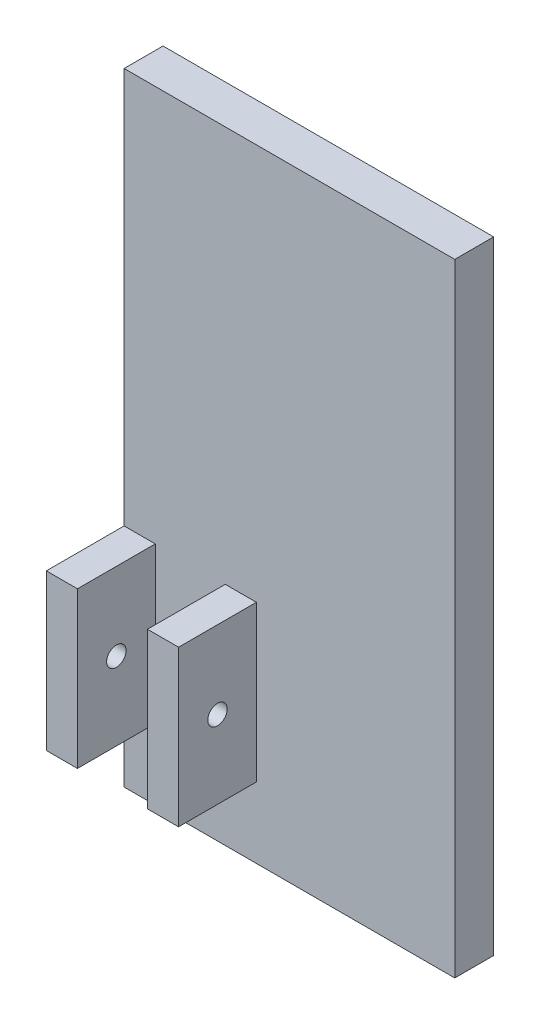
ISO-10303-21;
HEADER;
FILE_DESCRIPTION(('STEP AP214'),'2;1');
FILE_NAME('part.step','',(''),(''),'','','');
FILE_SCHEMA(('AUTOMOTIVE_DESIGN { 1 0 10303 214 1 1 1 1 }'));
ENDSEC;
DATA;
#1=APPLICATION_CONTEXT('core data for automotive mechanical design processes');
#2=APPLICATION_PROTOCOL_DEFINITION('international standard','automotive_design',2000,#1);
#3=PRODUCT_CONTEXT('',#1,'mechanical');
#4=PRODUCT('Part','Part','',(#3));
#5=PRODUCT_RELATED_PRODUCT_CATEGORY('part','',(#4));
#6=PRODUCT_DEFINITION_FORMATION('','',#4);
#7=PRODUCT_DEFINITION_CONTEXT('part definition',#1,'design');
#8=PRODUCT_DEFINITION('design','',#6,#7);
#9=PRODUCT_DEFINITION_SHAPE('','',#8);
#10=(LENGTH_UNIT() NAMED_UNIT(*) SI_UNIT(.MILLI.,.METRE.));
#11=(NAMED_UNIT(*) PLANE_ANGLE_UNIT() SI_UNIT($,.RADIAN.));
#12=(NAMED_UNIT(*) SI_UNIT($,.STERADIAN.) SOLID_ANGLE_UNIT());
#13=UNCERTAINTY_MEASURE_WITH_UNIT(LENGTH_MEASURE(1.E-05),#10,'distance_accuracy_value','');
#14=(GEOMETRIC_REPRESENTATION_CONTEXT(3) GLOBAL_UNCERTAINTY_ASSIGNED_CONTEXT((#13)) GLOBAL_UNIT_ASSIGNED_CONTEXT((#10,
#11,#12)) REPRESENTATION_CONTEXT('',''));
#15=CARTESIAN_POINT('',(0.,0.,0.));
#16=DIRECTION('',(0.,0.,1.));
#17=DIRECTION('',(1.,0.,0.));
#18=AXIS2_PLACEMENT_3D('',#15,#16,#17);
#19=CARTESIAN_POINT('',(0.,0.,10.));
#20=DIRECTION('',(0.,0.,-1.));
#21=DIRECTION('',(-1.,0.,0.));
#22=AXIS2_PLACEMENT_3D('',#19,#20,#21);
#23=PLANE('',#22);
#24=DIRECTION('',(-1.,0.,0.));
#25=VECTOR('',#24,1.);
#26=CARTESIAN_POINT('',(-15.,54.15,10.));
#27=LINE('',#26,#25);
#28=CARTESIAN_POINT('',(-7.,54.15,10.));
#29=VERTEX_POINT('',#28);
#30=CARTESIAN_POINT('',(-15.,54.15,10.));
#31=VERTEX_POINT('',#30);
#32=EDGE_CURVE('E163',#29,#31,#27,.T.);
#33=ORIENTED_EDGE('',*,*,#32,.F.);
#34=DIRECTION('',(0.,1.,0.));
#35=VECTOR('',#34,1.);
#36=CARTESIAN_POINT('',(-7.,14.15,10.));
#37=LINE('',#36,#35);
#38=CARTESIAN_POINT('',(-7.,14.15,10.));
#39=VERTEX_POINT('',#38);
#40=EDGE_CURVE('E170',#39,#29,#37,.T.);
#41=ORIENTED_EDGE('',*,*,#40,.F.);
#42=DIRECTION('',(1.,0.,0.));
#43=VECTOR('',#42,1.);
#44=CARTESIAN_POINT('',(-15.,14.15,10.));
#45=LINE('',#44,#43);
#46=CARTESIAN_POINT('',(-15.,14.15,10.));
#47=VERTEX_POINT('',#46);
#48=EDGE_CURVE('E173',#47,#39,#45,.T.);
#49=ORIENTED_EDGE('',*,*,#48,.F.);
#50=DIRECTION('',(0.,-1.,0.));
#51=VECTOR('',#50,1.);
#52=CARTESIAN_POINT('',(-15.,-4.,10.));
#53=LINE('',#52,#51);
#54=CARTESIAN_POINT('',(-15.,-4.,10.));
#55=VERTEX_POINT('',#54);
#56=EDGE_CURVE('E211',#47,#55,#53,.T.);
#57=ORIENTED_EDGE('',*,*,#56,.T.);
#58=DIRECTION('',(1.,0.,0.));
#59=VECTOR('',#58,1.);
#60=CARTESIAN_POINT('',(69.9999999999995,-4.,10.));
#61=LINE('',#60,#59);
#62=CARTESIAN_POINT('',(69.9999999999995,-4.,10.));
#63=VERTEX_POINT('',#62);
#64=EDGE_CURVE('E203',#55,#63,#61,.T.);
#65=ORIENTED_EDGE('',*,*,#64,.T.);
#66=DIRECTION('',(0.,1.,0.));
#67=VECTOR('',#66,1.);
#68=CARTESIAN_POINT('',(69.9999999999995,-4.,10.));
#69=LINE('',#68,#67);
#70=CARTESIAN_POINT('',(69.9999999999995,156.,10.));
#71=VERTEX_POINT('',#70);
#72=EDGE_CURVE('E206',#63,#71,#69,.T.);
#73=ORIENTED_EDGE('',*,*,#72,.T.);
#74=DIRECTION('',(-1.,0.,0.));
#75=VECTOR('',#74,1.);
#76=CARTESIAN_POINT('',(-15.,156.,10.));
#77=LINE('',#76,#75);
#78=CARTESIAN_POINT('',(-15.,156.,10.));
#79=VERTEX_POINT('',#78);
#80=EDGE_CURVE('E209',#71,#79,#77,.T.);
#81=ORIENTED_EDGE('',*,*,#80,.T.);
#82=EDGE_CURVE('E219',#79,#31,#53,.T.);
#83=ORIENTED_EDGE('',*,*,#82,.T.);
#84=EDGE_LOOP('',(#33,#41,#49,#57,#65,#73,#81,#83));
#85=FACE_BOUND('',#84,.T.);
#86=DIRECTION('',(-1.,0.,0.));
#87=VECTOR('',#86,1.);
#88=CARTESIAN_POINT('',(11.,54.15,10.));
#89=LINE('',#88,#87);
#90=CARTESIAN_POINT('',(19.,54.15,10.));
#91=VERTEX_POINT('',#90);
#92=CARTESIAN_POINT('',(11.,54.15,10.));
#93=VERTEX_POINT('',#92);
#94=EDGE_CURVE('E50',#91,#93,#89,.T.);
#95=ORIENTED_EDGE('',*,*,#94,.F.);
#96=DIRECTION('',(0.,1.,0.));
#97=VECTOR('',#96,1.);
#98=CARTESIAN_POINT('',(19.,54.15,10.));
#99=LINE('',#98,#97);
#100=CARTESIAN_POINT('',(19.,14.15,10.));
#101=VERTEX_POINT('',#100);
#102=EDGE_CURVE('E55',#101,#91,#99,.T.);
#103=ORIENTED_EDGE('',*,*,#102,.F.);
#104=DIRECTION('',(1.,0.,0.));
#105=VECTOR('',#104,1.);
#106=CARTESIAN_POINT('',(11.,14.15,10.));
#107=LINE('',#106,#105);
#108=CARTESIAN_POINT('',(11.,14.15,10.));
#109=VERTEX_POINT('',#108);
#110=EDGE_CURVE('E121',#109,#101,#107,.T.);
#111=ORIENTED_EDGE('',*,*,#110,.F.);
#112=DIRECTION('',(0.,-1.,0.));
#113=VECTOR('',#112,1.);
#114=CARTESIAN_POINT('',(11.,54.15,10.));
#115=LINE('',#114,#113);
#116=EDGE_CURVE('E124',#93,#109,#115,.T.);
#117=ORIENTED_EDGE('',*,*,#116,.F.);
#118=EDGE_LOOP('',(#95,#103,#111,#117));
#119=FACE_BOUND('',#118,.T.);
#120=ADVANCED_FACE('F33',(#85,#119),#23,.F.);
#121=CARTESIAN_POINT('',(69.9999999999995,-4.,10.));
#122=DIRECTION('',(0.,1.,0.));
#123=DIRECTION('',(0.,0.,1.));
#124=AXIS2_PLACEMENT_3D('',#121,#122,#123);
#125=PLANE('',#124);
#126=DIRECTION('',(1.,0.,0.));
#127=VECTOR('',#126,1.);
#128=CARTESIAN_POINT('',(69.9999999999995,-4.,0.));
#129=LINE('',#128,#127);
#130=CARTESIAN_POINT('',(-15.,-4.,0.));
#131=VERTEX_POINT('',#130);
#132=CARTESIAN_POINT('',(69.9999999999995,-4.,0.));
#133=VERTEX_POINT('',#132);
#134=EDGE_CURVE('E201',#131,#133,#129,.T.);
#135=ORIENTED_EDGE('',*,*,#134,.T.);
#136=DIRECTION('',(0.,0.,-1.));
#137=VECTOR('',#136,1.);
#138=CARTESIAN_POINT('',(69.9999999999995,-4.,10.));
#139=LINE('',#138,#137);
#140=EDGE_CURVE('E11',#63,#133,#139,.T.);
#141=ORIENTED_EDGE('',*,*,#140,.F.);
#142=ORIENTED_EDGE('',*,*,#64,.F.);
#143=DIRECTION('',(0.,0.,-1.));
#144=VECTOR('',#143,1.);
#145=CARTESIAN_POINT('',(-15.,-4.,10.));
#146=LINE('',#145,#144);
#147=EDGE_CURVE('E220',#55,#131,#146,.T.);
#148=ORIENTED_EDGE('',*,*,#147,.T.);
#149=EDGE_LOOP('',(#135,#141,#142,#148));
#150=FACE_BOUND('',#149,.T.);
#151=ADVANCED_FACE('F35',(#150),#125,.F.);
#152=CARTESIAN_POINT('',(69.9999999999995,-4.,10.));
#153=DIRECTION('',(-1.,0.,0.));
#154=DIRECTION('',(0.,0.,1.));
#155=AXIS2_PLACEMENT_3D('',#152,#153,#154);
#156=PLANE('',#155);
#157=DIRECTION('',(0.,1.,0.));
#158=VECTOR('',#157,1.);
#159=CARTESIAN_POINT('',(69.9999999999995,-4.,0.));
#160=LINE('',#159,#158);
#161=CARTESIAN_POINT('',(69.9999999999995,156.,0.));
#162=VERTEX_POINT('',#161);
#163=EDGE_CURVE('E231',#133,#162,#160,.T.);
#164=ORIENTED_EDGE('',*,*,#163,.T.);
#165=DIRECTION('',(0.,0.,-1.));
#166=VECTOR('',#165,1.);
#167=CARTESIAN_POINT('',(69.9999999999995,156.,10.));
#168=LINE('',#167,#166);
#169=EDGE_CURVE('E42',#71,#162,#168,.T.);
#170=ORIENTED_EDGE('',*,*,#169,.F.);
#171=ORIENTED_EDGE('',*,*,#72,.F.);
#172=ORIENTED_EDGE('',*,*,#140,.T.);
#173=EDGE_LOOP('',(#164,#170,#171,#172));
#174=FACE_BOUND('',#173,.T.);
#175=ADVANCED_FACE('F244',(#174),#156,.F.);
#176=CARTESIAN_POINT('',(-15.,156.,10.));
#177=DIRECTION('',(0.,-1.,0.));
#178=DIRECTION('',(0.,0.,-1.));
#179=AXIS2_PLACEMENT_3D('',#176,#177,#178);
#180=PLANE('',#179);
#181=DIRECTION('',(-1.,0.,0.));
#182=VECTOR('',#181,1.);
#183=CARTESIAN_POINT('',(-15.,156.,0.));
#184=LINE('',#183,#182);
#185=CARTESIAN_POINT('',(-15.,156.,0.));
#186=VERTEX_POINT('',#185);
#187=EDGE_CURVE('E230',#162,#186,#184,.T.);
#188=ORIENTED_EDGE('',*,*,#187,.T.);
#189=DIRECTION('',(0.,0.,-1.));
#190=VECTOR('',#189,1.);
#191=CARTESIAN_POINT('',(-15.,156.,10.));
#192=LINE('',#191,#190);
#193=EDGE_CURVE('E224',#79,#186,#192,.T.);
#194=ORIENTED_EDGE('',*,*,#193,.F.);
#195=ORIENTED_EDGE('',*,*,#80,.F.);
#196=ORIENTED_EDGE('',*,*,#169,.T.);
#197=EDGE_LOOP('',(#188,#194,#195,#196));
#198=FACE_BOUND('',#197,.T.);
#199=ADVANCED_FACE('F253',(#198),#180,.F.);
#200=CARTESIAN_POINT('',(-15.,-4.,10.));
#201=DIRECTION('',(1.,0.,0.));
#202=DIRECTION('',(0.,0.,-1.));
#203=AXIS2_PLACEMENT_3D('',#200,#201,#202);
#204=PLANE('',#203);
#205=CARTESIAN_POINT('',(-15.,34.15,20.));
#206=DIRECTION('',(-1.,0.,0.));
#207=DIRECTION('',(0.,-1.,0.));
#208=AXIS2_PLACEMENT_3D('',#205,#206,#207);
#209=CIRCLE('',#208,2.5);
#210=CARTESIAN_POINT('',(-15.,31.65,20.));
#211=VERTEX_POINT('',#210);
#212=EDGE_CURVE('E268',#211,#211,#209,.T.);
#213=ORIENTED_EDGE('',*,*,#212,.F.);
#214=EDGE_LOOP('',(#213));
#215=FACE_BOUND('',#214,.T.);
#216=DIRECTION('',(0.,-1.,0.));
#217=VECTOR('',#216,1.);
#218=CARTESIAN_POINT('',(-15.,-4.,0.));
#219=LINE('',#218,#217);
#220=EDGE_CURVE('E207',#186,#131,#219,.T.);
#221=ORIENTED_EDGE('',*,*,#220,.T.);
#222=ORIENTED_EDGE('',*,*,#147,.F.);
#223=ORIENTED_EDGE('',*,*,#56,.F.);
#224=DIRECTION('',(0.,0.,-1.));
#225=VECTOR('',#224,1.);
#226=CARTESIAN_POINT('',(-15.,14.15,30.));
#227=LINE('',#226,#225);
#228=CARTESIAN_POINT('',(-15.,14.15,30.));
#229=VERTEX_POINT('',#228);
#230=EDGE_CURVE('E196',#229,#47,#227,.T.);
#231=ORIENTED_EDGE('',*,*,#230,.F.);
#232=DIRECTION('',(0.,-1.,0.));
#233=VECTOR('',#232,1.);
#234=CARTESIAN_POINT('',(-15.,14.15,30.));
#235=LINE('',#234,#233);
#236=CARTESIAN_POINT('',(-15.,54.15,30.));
#237=VERTEX_POINT('',#236);
#238=EDGE_CURVE('E159',#237,#229,#235,.T.);
#239=ORIENTED_EDGE('',*,*,#238,.F.);
#240=DIRECTION('',(0.,0.,-1.));
#241=VECTOR('',#240,1.);
#242=CARTESIAN_POINT('',(-15.,54.15,30.));
#243=LINE('',#242,#241);
#244=EDGE_CURVE('E169',#237,#31,#243,.T.);
#245=ORIENTED_EDGE('',*,*,#244,.T.);
#246=ORIENTED_EDGE('',*,*,#82,.F.);
#247=ORIENTED_EDGE('',*,*,#193,.T.);
#248=EDGE_LOOP('',(#221,#222,#223,#231,#239,#245,#246,#247));
#249=FACE_BOUND('',#248,.T.);
#250=ADVANCED_FACE('F250',(#215,#249),#204,.F.);
#251=CARTESIAN_POINT('',(0.,0.,0.));
#252=DIRECTION('',(0.,0.,-1.));
#253=DIRECTION('',(-1.,0.,0.));
#254=AXIS2_PLACEMENT_3D('',#251,#252,#253);
#255=PLANE('',#254);
#256=ORIENTED_EDGE('',*,*,#134,.F.);
#257=ORIENTED_EDGE('',*,*,#220,.F.);
#258=ORIENTED_EDGE('',*,*,#187,.F.);
#259=ORIENTED_EDGE('',*,*,#163,.F.);
#260=EDGE_LOOP('',(#256,#257,#258,#259));
#261=FACE_BOUND('',#260,.T.);
#262=ADVANCED_FACE('F242',(#261),#255,.T.);
#263=CARTESIAN_POINT('',(-15.,14.15,30.));
#264=DIRECTION('',(0.,1.,0.));
#265=DIRECTION('',(0.,0.,1.));
#266=AXIS2_PLACEMENT_3D('',#263,#264,#265);
#267=PLANE('',#266);
#268=ORIENTED_EDGE('',*,*,#48,.T.);
#269=DIRECTION('',(0.,0.,-1.));
#270=VECTOR('',#269,1.);
#271=CARTESIAN_POINT('',(-7.,14.15,30.));
#272=LINE('',#271,#270);
#273=CARTESIAN_POINT('',(-7.,14.15,30.));
#274=VERTEX_POINT('',#273);
#275=EDGE_CURVE('E191',#274,#39,#272,.T.);
#276=ORIENTED_EDGE('',*,*,#275,.F.);
#277=DIRECTION('',(1.,0.,0.));
#278=VECTOR('',#277,1.);
#279=CARTESIAN_POINT('',(-15.,14.15,30.));
#280=LINE('',#279,#278);
#281=EDGE_CURVE('E162',#229,#274,#280,.T.);
#282=ORIENTED_EDGE('',*,*,#281,.F.);
#283=ORIENTED_EDGE('',*,*,#230,.T.);
#284=EDGE_LOOP('',(#268,#276,#282,#283));
#285=FACE_BOUND('',#284,.T.);
#286=ADVANCED_FACE('F259',(#285),#267,.F.);
#287=CARTESIAN_POINT('',(-7.,14.15,30.));
#288=DIRECTION('',(-1.,0.,0.));
#289=DIRECTION('',(0.,0.,1.));
#290=AXIS2_PLACEMENT_3D('',#287,#288,#289);
#291=PLANE('',#290);
#292=CARTESIAN_POINT('',(-7.,34.15,20.));
#293=DIRECTION('',(-1.,0.,0.));
#294=DIRECTION('',(0.,0.,1.));
#295=AXIS2_PLACEMENT_3D('',#292,#293,#294);
#296=CIRCLE('',#295,2.5);
#297=CARTESIAN_POINT('',(-7.,34.15,22.5));
#298=VERTEX_POINT('',#297);
#299=EDGE_CURVE('E142',#298,#298,#296,.T.);
#300=ORIENTED_EDGE('',*,*,#299,.T.);
#301=EDGE_LOOP('',(#300));
#302=FACE_BOUND('',#301,.T.);
#303=ORIENTED_EDGE('',*,*,#40,.T.);
#304=DIRECTION('',(0.,0.,-1.));
#305=VECTOR('',#304,1.);
#306=CARTESIAN_POINT('',(-7.,54.15,30.));
#307=LINE('',#306,#305);
#308=CARTESIAN_POINT('',(-7.,54.15,30.));
#309=VERTEX_POINT('',#308);
#310=EDGE_CURVE('E176',#309,#29,#307,.T.);
#311=ORIENTED_EDGE('',*,*,#310,.F.);
#312=DIRECTION('',(0.,1.,0.));
#313=VECTOR('',#312,1.);
#314=CARTESIAN_POINT('',(-7.,14.15,30.));
#315=LINE('',#314,#313);
#316=EDGE_CURVE('E165',#274,#309,#315,.T.);
#317=ORIENTED_EDGE('',*,*,#316,.F.);
#318=ORIENTED_EDGE('',*,*,#275,.T.);
#319=EDGE_LOOP('',(#303,#311,#317,#318));
#320=FACE_BOUND('',#319,.T.);
#321=ADVANCED_FACE('F257',(#302,#320),#291,.F.);
#322=CARTESIAN_POINT('',(-15.,54.15,30.));
#323=DIRECTION('',(0.,-1.,0.));
#324=DIRECTION('',(0.,0.,-1.));
#325=AXIS2_PLACEMENT_3D('',#322,#323,#324);
#326=PLANE('',#325);
#327=ORIENTED_EDGE('',*,*,#32,.T.);
#328=ORIENTED_EDGE('',*,*,#244,.F.);
#329=DIRECTION('',(-1.,0.,0.));
#330=VECTOR('',#329,1.);
#331=CARTESIAN_POINT('',(-15.,54.15,30.));
#332=LINE('',#331,#330);
#333=EDGE_CURVE('E167',#309,#237,#332,.T.);
#334=ORIENTED_EDGE('',*,*,#333,.F.);
#335=ORIENTED_EDGE('',*,*,#310,.T.);
#336=EDGE_LOOP('',(#327,#328,#334,#335));
#337=FACE_BOUND('',#336,.T.);
#338=ADVANCED_FACE('F254',(#337),#326,.F.);
#339=CARTESIAN_POINT('',(0.,0.,30.));
#340=DIRECTION('',(0.,0.,-1.));
#341=DIRECTION('',(-1.,0.,0.));
#342=AXIS2_PLACEMENT_3D('',#339,#340,#341);
#343=PLANE('',#342);
#344=ORIENTED_EDGE('',*,*,#238,.T.);
#345=ORIENTED_EDGE('',*,*,#281,.T.);
#346=ORIENTED_EDGE('',*,*,#316,.T.);
#347=ORIENTED_EDGE('',*,*,#333,.T.);
#348=EDGE_LOOP('',(#344,#345,#346,#347));
#349=FACE_BOUND('',#348,.T.);
#350=ADVANCED_FACE('F256',(#349),#343,.F.);
#351=CARTESIAN_POINT('',(11.,54.15,70.7921561087423));
#352=DIRECTION('',(0.,-1.,0.));
#353=DIRECTION('',(0.,0.,-1.));
#354=AXIS2_PLACEMENT_3D('',#351,#352,#353);
#355=PLANE('',#354);
#356=DIRECTION('',(0.,0.,-1.));
#357=VECTOR('',#356,1.);
#358=CARTESIAN_POINT('',(11.,54.15,70.7921561087423));
#359=LINE('',#358,#357);
#360=CARTESIAN_POINT('',(11.,54.15,30.));
#361=VERTEX_POINT('',#360);
#362=EDGE_CURVE('E141',#361,#93,#359,.T.);
#363=ORIENTED_EDGE('',*,*,#362,.F.);
#364=DIRECTION('',(1.,0.,0.));
#365=VECTOR('',#364,1.);
#366=CARTESIAN_POINT('',(11.,54.15,30.));
#367=LINE('',#366,#365);
#368=CARTESIAN_POINT('',(19.,54.15,30.));
#369=VERTEX_POINT('',#368);
#370=EDGE_CURVE('E136',#361,#369,#367,.T.);
#371=ORIENTED_EDGE('',*,*,#370,.T.);
#372=DIRECTION('',(0.,0.,-1.));
#373=VECTOR('',#372,1.);
#374=CARTESIAN_POINT('',(19.,54.15,70.7921561087423));
#375=LINE('',#374,#373);
#376=EDGE_CURVE('E153',#369,#91,#375,.T.);
#377=ORIENTED_EDGE('',*,*,#376,.T.);
#378=ORIENTED_EDGE('',*,*,#94,.T.);
#379=EDGE_LOOP('',(#363,#371,#377,#378));
#380=FACE_BOUND('',#379,.T.);
#381=ADVANCED_FACE('F298',(#380),#355,.F.);
#382=CARTESIAN_POINT('',(19.,54.15,70.7921561087423));
#383=DIRECTION('',(-1.,0.,0.));
#384=DIRECTION('',(0.,-1.,0.));
#385=AXIS2_PLACEMENT_3D('',#382,#383,#384);
#386=PLANE('',#385);
#387=CARTESIAN_POINT('',(19.,34.15,20.));
#388=DIRECTION('',(-1.,0.,0.));
#389=DIRECTION('',(0.,-1.,0.));
#390=AXIS2_PLACEMENT_3D('',#387,#388,#389);
#391=CIRCLE('',#390,2.5);
#392=CARTESIAN_POINT('',(19.,31.65,20.));
#393=VERTEX_POINT('',#392);
#394=EDGE_CURVE('E265',#393,#393,#391,.F.);
#395=ORIENTED_EDGE('',*,*,#394,.F.);
#396=EDGE_LOOP('',(#395));
#397=FACE_BOUND('',#396,.T.);
#398=ORIENTED_EDGE('',*,*,#376,.F.);
#399=DIRECTION('',(0.,-1.,0.));
#400=VECTOR('',#399,1.);
#401=CARTESIAN_POINT('',(19.,54.15,30.));
#402=LINE('',#401,#400);
#403=CARTESIAN_POINT('',(19.,14.15,30.));
#404=VERTEX_POINT('',#403);
#405=EDGE_CURVE('E158',#369,#404,#402,.T.);
#406=ORIENTED_EDGE('',*,*,#405,.T.);
#407=DIRECTION('',(0.,0.,-1.));
#408=VECTOR('',#407,1.);
#409=CARTESIAN_POINT('',(19.,14.15,70.7921561087423));
#410=LINE('',#409,#408);
#411=EDGE_CURVE('E137',#404,#101,#410,.T.);
#412=ORIENTED_EDGE('',*,*,#411,.T.);
#413=ORIENTED_EDGE('',*,*,#102,.T.);
#414=EDGE_LOOP('',(#398,#406,#412,#413));
#415=FACE_BOUND('',#414,.T.);
#416=ADVANCED_FACE('F305',(#397,#415),#386,.F.);
#417=CARTESIAN_POINT('',(11.,14.15,70.7921561087423));
#418=DIRECTION('',(0.,1.,0.));
#419=DIRECTION('',(-1.,0.,0.));
#420=AXIS2_PLACEMENT_3D('',#417,#418,#419);
#421=PLANE('',#420);
#422=ORIENTED_EDGE('',*,*,#411,.F.);
#423=DIRECTION('',(-1.,0.,0.));
#424=VECTOR('',#423,1.);
#425=CARTESIAN_POINT('',(11.,14.15,30.));
#426=LINE('',#425,#424);
#427=CARTESIAN_POINT('',(11.,14.15,30.));
#428=VERTEX_POINT('',#427);
#429=EDGE_CURVE('E133',#404,#428,#426,.T.);
#430=ORIENTED_EDGE('',*,*,#429,.T.);
#431=DIRECTION('',(0.,0.,-1.));
#432=VECTOR('',#431,1.);
#433=CARTESIAN_POINT('',(11.,14.15,70.7921561087423));
#434=LINE('',#433,#432);
#435=EDGE_CURVE('E131',#428,#109,#434,.T.);
#436=ORIENTED_EDGE('',*,*,#435,.T.);
#437=ORIENTED_EDGE('',*,*,#110,.T.);
#438=EDGE_LOOP('',(#422,#430,#436,#437));
#439=FACE_BOUND('',#438,.T.);
#440=ADVANCED_FACE('F132',(#439),#421,.F.);
#441=CARTESIAN_POINT('',(11.,54.15,70.7921561087423));
#442=DIRECTION('',(1.,0.,0.));
#443=DIRECTION('',(0.,1.,0.));
#444=AXIS2_PLACEMENT_3D('',#441,#442,#443);
#445=PLANE('',#444);
#446=CARTESIAN_POINT('',(11.,34.15,20.));
#447=DIRECTION('',(1.,0.,0.));
#448=DIRECTION('',(0.,1.,0.));
#449=AXIS2_PLACEMENT_3D('',#446,#447,#448);
#450=CIRCLE('',#449,2.5);
#451=CARTESIAN_POINT('',(11.,36.65,20.));
#452=VERTEX_POINT('',#451);
#453=EDGE_CURVE('E37',#452,#452,#450,.T.);
#454=ORIENTED_EDGE('',*,*,#453,.T.);
#455=EDGE_LOOP('',(#454));
#456=FACE_BOUND('',#455,.T.);
#457=ORIENTED_EDGE('',*,*,#435,.F.);
#458=DIRECTION('',(0.,1.,0.));
#459=VECTOR('',#458,1.);
#460=CARTESIAN_POINT('',(11.,54.15,30.));
#461=LINE('',#460,#459);
#462=EDGE_CURVE('E147',#428,#361,#461,.T.);
#463=ORIENTED_EDGE('',*,*,#462,.T.);
#464=ORIENTED_EDGE('',*,*,#362,.T.);
#465=ORIENTED_EDGE('',*,*,#116,.T.);
#466=EDGE_LOOP('',(#457,#463,#464,#465));
#467=FACE_BOUND('',#466,.T.);
#468=ADVANCED_FACE('F139',(#456,#467),#445,.F.);
#469=CARTESIAN_POINT('',(0.,0.,30.));
#470=DIRECTION('',(0.,0.,-1.));
#471=DIRECTION('',(-1.,0.,0.));
#472=AXIS2_PLACEMENT_3D('',#469,#470,#471);
#473=PLANE('',#472);
#474=ORIENTED_EDGE('',*,*,#429,.F.);
#475=ORIENTED_EDGE('',*,*,#405,.F.);
#476=ORIENTED_EDGE('',*,*,#370,.F.);
#477=ORIENTED_EDGE('',*,*,#462,.F.);
#478=EDGE_LOOP('',(#474,#475,#476,#477));
#479=FACE_BOUND('',#478,.T.);
#480=ADVANCED_FACE('F301',(#479),#473,.F.);
#481=CARTESIAN_POINT('',(26.0710678118655,34.15,20.));
#482=DIRECTION('',(-1.,0.,0.));
#483=DIRECTION('',(0.,-1.,0.));
#484=AXIS2_PLACEMENT_3D('',#481,#482,#483);
#485=CYLINDRICAL_SURFACE('',#484,2.5);
#486=ORIENTED_EDGE('',*,*,#394,.T.);
#487=EDGE_LOOP('',(#486));
#488=FACE_BOUND('',#487,.T.);
#489=ORIENTED_EDGE('',*,*,#453,.F.);
#490=EDGE_LOOP('',(#489));
#491=FACE_BOUND('',#490,.T.);
#492=ADVANCED_FACE('F314',(#488,#491),#485,.F.);
#493=ORIENTED_EDGE('',*,*,#212,.T.);
#494=EDGE_LOOP('',(#493));
#495=FACE_BOUND('',#494,.T.);
#496=ORIENTED_EDGE('',*,*,#299,.F.);
#497=EDGE_LOOP('',(#496));
#498=FACE_BOUND('',#497,.T.);
#499=ADVANCED_FACE('F272',(#495,#498),#485,.F.);
#500=CLOSED_SHELL('',(#120,#151,#175,#199,#250,#262,#286,#321,#338,#350,#381,#416,#440,#468,
#480,#492,#499));
#501=MANIFOLD_SOLID_BREP('B2',#500);
#502=ADVANCED_BREP_SHAPE_REPRESENTATION('',(#18,#501),#14);
#503=SHAPE_DEFINITION_REPRESENTATION(#9,#502);
ENDSEC;
END-ISO-10303-21;
